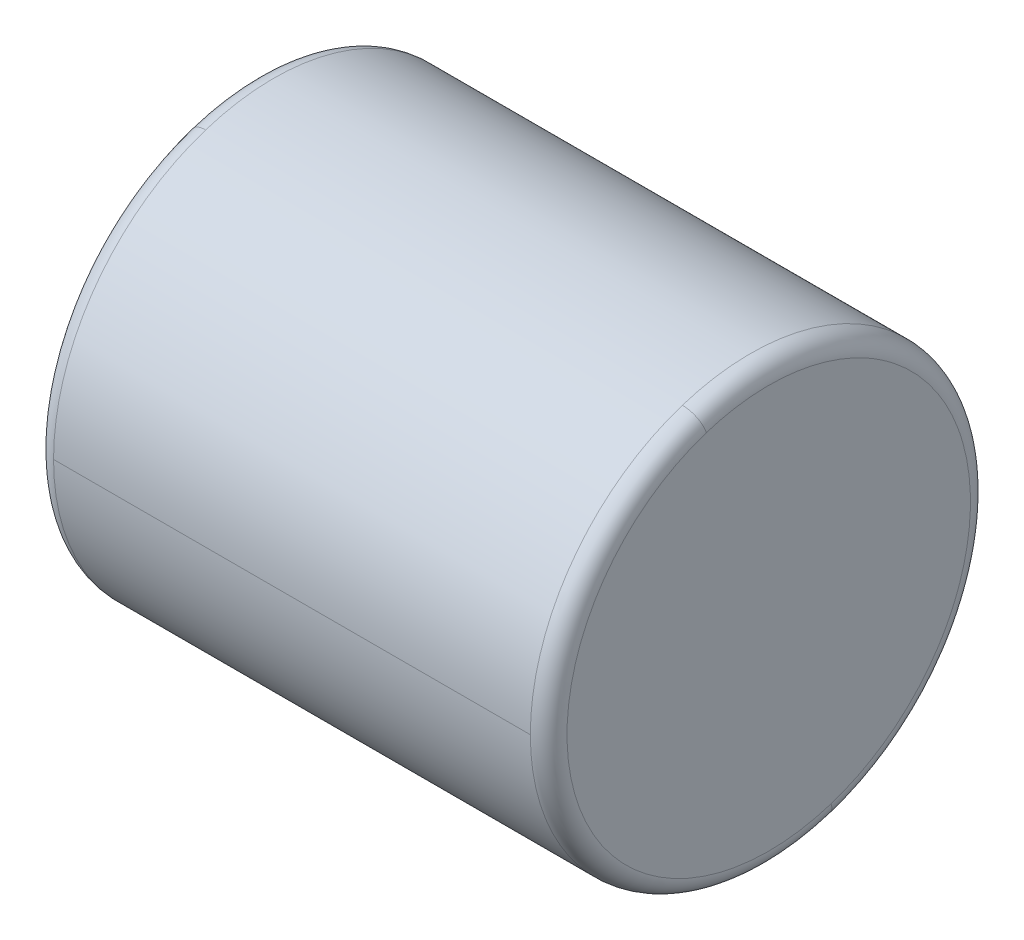
ISO-10303-21;
HEADER;
FILE_DESCRIPTION(('STEP AP214'),'2;1');
FILE_NAME('part.step','',(''),(''),'','','');
FILE_SCHEMA(('AUTOMOTIVE_DESIGN { 1 0 10303 214 1 1 1 1 }'));
ENDSEC;
DATA;
#1=APPLICATION_CONTEXT('core data for automotive mechanical design processes');
#2=APPLICATION_PROTOCOL_DEFINITION('international standard','automotive_design',2000,#1);
#3=PRODUCT_CONTEXT('',#1,'mechanical');
#4=PRODUCT('Part','Part','',(#3));
#5=PRODUCT_RELATED_PRODUCT_CATEGORY('part','',(#4));
#6=PRODUCT_DEFINITION_FORMATION('','',#4);
#7=PRODUCT_DEFINITION_CONTEXT('part definition',#1,'design');
#8=PRODUCT_DEFINITION('design','',#6,#7);
#9=PRODUCT_DEFINITION_SHAPE('','',#8);
#10=(LENGTH_UNIT() NAMED_UNIT(*) SI_UNIT(.MILLI.,.METRE.));
#11=(NAMED_UNIT(*) PLANE_ANGLE_UNIT() SI_UNIT($,.RADIAN.));
#12=(NAMED_UNIT(*) SI_UNIT($,.STERADIAN.) SOLID_ANGLE_UNIT());
#13=UNCERTAINTY_MEASURE_WITH_UNIT(LENGTH_MEASURE(1.E-05),#10,'distance_accuracy_value','');
#14=(GEOMETRIC_REPRESENTATION_CONTEXT(3) GLOBAL_UNCERTAINTY_ASSIGNED_CONTEXT((#13)) GLOBAL_UNIT_ASSIGNED_CONTEXT((#10,
#11,#12)) REPRESENTATION_CONTEXT('',''));
#15=CARTESIAN_POINT('',(0.,0.,0.));
#16=DIRECTION('',(0.,0.,1.));
#17=DIRECTION('',(1.,0.,0.));
#18=AXIS2_PLACEMENT_3D('',#15,#16,#17);
#19=CARTESIAN_POINT('',(3.5,39.,0.));
#20=DIRECTION('',(1.,0.,0.));
#21=DIRECTION('',(0.,0.,-1.));
#22=AXIS2_PLACEMENT_3D('',#19,#20,#21);
#23=PLANE('',#22);
#24=CARTESIAN_POINT('',(3.5,44.2308108396229,1.69959346906208));
#25=CARTESIAN_POINT('',(3.5,44.2030030939888,1.78518308762205));
#26=CARTESIAN_POINT('',(3.5,44.173091163384,1.87008884424502));
#27=CARTESIAN_POINT('',(3.5,44.1091388367265,2.03833106983926));
#28=CARTESIAN_POINT('',(3.5,44.0750984406738,2.12166753881053));
#29=CARTESIAN_POINT('',(3.5,44.002969087614,2.28656962532369));
#30=CARTESIAN_POINT('',(3.5,43.9648801306069,2.36813524286558));
#31=CARTESIAN_POINT('',(3.5,43.8847459784481,2.5292993418742));
#32=CARTESIAN_POINT('',(3.5,43.8427007832964,2.60889782334093));
#33=CARTESIAN_POINT('',(3.5,43.7547552945037,2.76593583312516));
#34=CARTESIAN_POINT('',(3.5,43.7088550008626,2.84337536144267));
#35=CARTESIAN_POINT('',(3.5,43.6133099333532,2.99590892169148));
#36=CARTESIAN_POINT('',(3.5,43.5636651594849,3.07100295362277));
#37=CARTESIAN_POINT('',(3.5,43.4607507192951,3.21866460888048));
#38=CARTESIAN_POINT('',(3.5,43.4074810529737,3.29123223220689));
#39=CARTESIAN_POINT('',(3.5,43.2974451620729,3.43366624959757));
#40=CARTESIAN_POINT('',(3.5,43.2406789374936,3.50353264366183));
#41=CARTESIAN_POINT('',(3.5,43.1237866841062,3.64039588796964));
#42=CARTESIAN_POINT('',(3.5,43.0636606552981,3.70739273821319));
#43=CARTESIAN_POINT('',(3.5,42.9401936425316,3.83835549367835));
#44=CARTESIAN_POINT('',(3.5,42.8768526585731,3.90232139889995));
#45=CARTESIAN_POINT('',(3.5,42.7471083294283,4.02706816483154));
#46=CARTESIAN_POINT('',(3.5,42.6807049842419,4.08784902554154));
#47=CARTESIAN_POINT('',(3.5,42.544995904131,4.20607927603838));
#48=CARTESIAN_POINT('',(3.5,42.4756901692065,4.26352866582523));
#49=CARTESIAN_POINT('',(3.5,42.3343432732012,4.37495757386229));
#50=CARTESIAN_POINT('',(3.5,42.2623021121204,4.42893709211251));
#51=CARTESIAN_POINT('',(3.5,42.1156579172708,4.53329621568919));
#52=CARTESIAN_POINT('',(3.5,42.0410548835019,4.58367582101566));
#53=CARTESIAN_POINT('',(3.5,41.8894666685186,4.68071374986278));
#54=CARTESIAN_POINT('',(3.5,41.8124814873042,4.72737207338344));
#55=CARTESIAN_POINT('',(3.5,41.6563144414746,4.81685503463081));
#56=CARTESIAN_POINT('',(3.5,41.5771325768593,4.85967967235753));
#57=CARTESIAN_POINT('',(3.5,41.4167629202753,4.94139209371376));
#58=CARTESIAN_POINT('',(3.5,41.3355751283066,4.98027987734326));
#59=CARTESIAN_POINT('',(3.5,41.1713892055177,5.05402490642811));
#60=CARTESIAN_POINT('',(3.5,41.0883910746976,5.08888215188346));
#61=CARTESIAN_POINT('',(3.5,40.9207844239728,5.15448213046259));
#62=CARTESIAN_POINT('',(3.5,40.8361759040681,5.18522486358635));
#63=CARTESIAN_POINT('',(3.5,40.6655523045096,5.24252175556546));
#64=CARTESIAN_POINT('',(3.5,40.5795372248558,5.2690759144208));
#65=CARTESIAN_POINT('',(3.5,40.4063077236598,5.3179316865685));
#66=CARTESIAN_POINT('',(3.5,40.3190933021177,5.34023329986087));
#67=CARTESIAN_POINT('',(3.5,40.1436752243257,5.3805302543428));
#68=CARTESIAN_POINT('',(3.5,40.0554715680758,5.39852559553238));
#69=CARTESIAN_POINT('',(3.5,39.878287511202,5.4301666534556));
#70=CARTESIAN_POINT('',(3.5,39.789307110578,5.44381237018925));
#71=CARTESIAN_POINT('',(3.5,39.6107839265349,5.4667213054738));
#72=CARTESIAN_POINT('',(3.5,39.5212411431158,5.47598452402469));
#73=CARTESIAN_POINT('',(3.5,39.3418089098905,5.49010614703887));
#74=CARTESIAN_POINT('',(3.5,39.2519194600844,5.49496455150216));
#75=CARTESIAN_POINT('',(3.5,39.0720104456432,5.50026484201923));
#76=CARTESIAN_POINT('',(3.5,38.9819908810081,5.50070672807301));
#77=CARTESIAN_POINT('',(3.5,38.802038501925,5.49717291722886));
#78=CARTESIAN_POINT('',(3.5,38.7121056874769,5.49319722033093));
#79=CARTESIAN_POINT('',(3.5,38.532543464795,5.4808378213854));
#80=CARTESIAN_POINT('',(3.5,38.4429140565612,5.47245411933782));
#81=CARTESIAN_POINT('',(3.5,38.2641745714027,5.45129890716554));
#82=CARTESIAN_POINT('',(3.5,38.1750644944781,5.43852739704085));
#83=CARTESIAN_POINT('',(3.5,37.9975783459186,5.40862733640092));
#84=CARTESIAN_POINT('',(3.5,37.9092022742837,5.39149878588567));
#85=CARTESIAN_POINT('',(3.5,37.7333970420009,5.3529259086431));
#86=CARTESIAN_POINT('',(3.5,37.6459678813531,5.33148158191578));
#87=CARTESIAN_POINT('',(3.5,37.4722670955504,5.28432881351043));
#88=CARTESIAN_POINT('',(3.5,37.3859954703956,5.25862037183242));
#89=CARTESIAN_POINT('',(3.5,37.2148175914803,5.20300130741348));
#90=CARTESIAN_POINT('',(3.5,37.1299113377199,5.17309068467256));
#91=CARTESIAN_POINT('',(3.5,36.9616687481958,5.10913931543787));
#92=CARTESIAN_POINT('',(3.5,36.8783324124321,5.0750985689441));
#93=CARTESIAN_POINT('',(3.5,36.7134304234337,5.00296895934363));
#94=CARTESIAN_POINT('',(3.5,36.6318647701989,4.96488009623692));
#95=CARTESIAN_POINT('',(3.5,36.4707006450613,4.884746012818));
#96=CARTESIAN_POINT('',(3.5,36.3911021731585,4.84270079250577));
#97=CARTESIAN_POINT('',(3.5,36.2340641703755,4.75475528529427));
#98=CARTESIAN_POINT('',(3.5,36.1566246394953,4.70885499839499));
#99=CARTESIAN_POINT('',(3.5,36.0040910773705,4.61330993582089));
#100=CARTESIAN_POINT('',(3.5,35.9289970461259,4.56366516014608));
#101=CARTESIAN_POINT('',(3.5,35.7813353913709,4.46075071863389));
#102=CARTESIAN_POINT('',(3.5,35.7087677678605,4.40748105279652));
#103=CARTESIAN_POINT('',(3.5,35.5663337503351,4.29744516225009));
#104=CARTESIAN_POINT('',(3.5,35.4964673563201,4.24067893754103));
#105=CARTESIAN_POINT('',(3.5,35.3596041120484,4.12378668405869));
#106=CARTESIAN_POINT('',(3.5,35.2926072617916,4.0636606552854));
#107=CARTESIAN_POINT('',(3.5,35.1616445063168,3.94019364254433));
#108=CARTESIAN_POINT('',(3.5,35.0976786010988,3.87685265857655));
#109=CARTESIAN_POINT('',(3.5,34.9729318351698,3.74710832942488));
#110=CARTESIAN_POINT('',(3.5,34.9121509744588,3.680704984241));
#111=CARTESIAN_POINT('',(3.5,34.7939207239613,3.54499590413192));
#112=CARTESIAN_POINT('',(3.5,34.7364713341747,3.47569016920673));
#113=CARTESIAN_POINT('',(3.5,34.6250424261378,3.33434327320094));
#114=CARTESIAN_POINT('',(3.5,34.5710629078875,3.26230211212034));
#115=CARTESIAN_POINT('',(3.5,34.4667037843108,3.11565791727084));
#116=CARTESIAN_POINT('',(3.5,34.4163241789843,3.04105488350194));
#117=CARTESIAN_POINT('',(3.5,34.3192862501372,2.88946666851863));
#118=CARTESIAN_POINT('',(3.5,34.2726279266166,2.81248148730423));
#119=CARTESIAN_POINT('',(3.5,34.1831449653692,2.65631444147458));
#120=CARTESIAN_POINT('',(3.5,34.1403203276425,2.57713257685932));
#121=CARTESIAN_POINT('',(3.5,34.0586079062862,2.41676292027534));
#122=CARTESIAN_POINT('',(3.5,34.0197201226568,2.33557512830661));
#123=CARTESIAN_POINT('',(3.5,33.9459750935719,2.17138920551772));
#124=CARTESIAN_POINT('',(3.5,33.9111178481165,2.08839107469757));
#125=CARTESIAN_POINT('',(3.5,33.8455178695374,1.92078442397279));
#126=CARTESIAN_POINT('',(3.5,33.8147751364137,1.83617590406817));
#127=CARTESIAN_POINT('',(3.5,33.7574782444345,1.66555230450964));
#128=CARTESIAN_POINT('',(3.5,33.7309240855789,1.57953722485574));
#129=CARTESIAN_POINT('',(3.5,33.6820683134318,1.40630772365988));
#130=CARTESIAN_POINT('',(3.5,33.6597667001401,1.31909330211792));
#131=CARTESIAN_POINT('',(3.5,33.6194697456563,1.14367522432541));
#132=CARTESIAN_POINT('',(3.5,33.6014744044641,1.05547156807484));
#133=CARTESIAN_POINT('',(3.5,33.5698333465479,0.878287511202944));
#134=CARTESIAN_POINT('',(3.5,33.5561876298239,0.789307110581609));
#135=CARTESIAN_POINT('',(3.5,33.5332786945131,0.610783926531369));
#136=CARTESIAN_POINT('',(3.5,33.5240154759263,0.521241143102463));
#137=CARTESIAN_POINT('',(3.5,33.5098938530101,0.341808909903803));
#138=CARTESIAN_POINT('',(3.5,33.5050354486808,0.251919460134048));
#139=CARTESIAN_POINT('',(3.5,33.4997351577979,0.0720104455935597));
#140=CARTESIAN_POINT('',(3.5,33.4992932712443,-0.0180091191771744));
#141=CARTESIAN_POINT('',(3.5,33.5028270834538,-0.19796149788968));
#142=CARTESIAN_POINT('',(3.5,33.5068027822168,-0.287894311831452));
#143=CARTESIAN_POINT('',(3.5,33.5191621760669,-0.46745653589656));
#144=CARTESIAN_POINT('',(3.5,33.527545871154,-0.557085946019896));
#145=CARTESIAN_POINT('',(3.5,33.5487011023426,-0.735825426016175));
#146=CARTESIAN_POINT('',(3.5,33.5614726384441,-0.824935495889118));
#147=CARTESIAN_POINT('',(3.5,33.5913726281141,-1.00242166371412));
#148=CARTESIAN_POINT('',(3.5,33.6085010816826,-1.09079776166617));
#149=CARTESIAN_POINT('',(3.5,33.6470742237886,-1.26660292204916));
#150=CARTESIAN_POINT('',(3.5,33.6685189123262,-1.35403198448008));
#151=CARTESIAN_POINT('',(3.5,33.7156706922476,-1.52773303861636));
#152=CARTESIAN_POINT('',(3.5,33.7413777836314,-1.61400503032172));
#153=CARTESIAN_POINT('',(3.5,33.7691891603771,-1.69959346906206));
#154=B_SPLINE_CURVE_WITH_KNOTS('',3,(#24,#25,#26,#27,#28,#29,#30,#31,#32,#33,#34,#35,#36,#37,
#38,#39,#40,#41,#42,#43,#44,#45,#46,#47,#48,#49,#50,#51,#52,#53,#54,#55,#56,#57,#58,#59,#60,#61,
#62,#63,#64,#65,#66,#67,#68,#69,#70,#71,#72,#73,#74,#75,#76,#77,#78,#79,#80,#81,#82,#83,#84,#85,
#86,#87,#88,#89,#90,#91,#92,#93,#94,#95,#96,#97,#98,#99,#100,#101,#102,#103,#104,#105,#106,#107,
#108,#109,#110,#111,#112,#113,#114,#115,#116,#117,#118,#119,#120,#121,#122,#123,#124,#125,#126,
#127,#128,#129,#130,#131,#132,#133,#134,#135,#136,#137,#138,#139,#140,#141,#142,#143,#144,#145,
#146,#147,#148,#149,#150,#151,#152,#153),.UNSPECIFIED.,.F.,.F.,(4,2,2,2,2,2,2,2,2,2,2,2,2,2,2,2,
2,2,2,2,2,2,2,2,2,2,2,2,2,2,2,2,2,2,2,2,2,2,2,2,2,2,2,2,2,2,2,2,2,2,2,2,2,2,2,2,2,2,2,2,2,2,2,2,
4),(0.,0.269953513752014,0.539907027504027,0.809860541256042,1.07981405500806,1.34976756876007,
1.61972108251209,1.8896745962641,2.15962811001611,2.42958162376813,2.69953513752014,
2.96948865127216,3.23944216502417,3.50939567877618,3.7793491925282,4.04930270628021,
4.31925622003223,4.58920973378424,4.85916324753626,5.12911676128827,5.39907027504028,
5.6690237887923,5.93897730254432,6.20893081629632,6.47888433004834,6.74883784380036,
7.01879135755237,7.28874487130439,7.55869838505639,7.82865189880841,8.09860541256043,
8.36855892631243,8.63851244006446,8.90846595381647,9.17841946756848,9.44837298132049,
9.71832649507251,9.98828000882452,10.2582335225765,10.5281870363286,10.7981405500806,
11.0680940638326,11.3380475775846,11.6080010913366,11.8779546050886,12.1479081188406,
12.4178616325927,12.6878151463447,12.9577686600967,13.2277221738487,13.4976756876007,
13.7676292013527,14.0375827151047,14.3075362288567,14.5774897426088,14.8474432563608,
15.1173967701128,15.3873502838648,15.6573037976168,15.9272573113688,16.1972108251208,
16.4671643388729,16.7371178526249,17.0070713663769,17.2770248801289),.UNSPECIFIED.);
#155=CARTESIAN_POINT('',(3.5,44.2308108396229,1.69959346906208));
#156=VERTEX_POINT('',#155);
#157=CARTESIAN_POINT('',(3.5,33.7691891603771,-1.69959346906208));
#158=VERTEX_POINT('',#157);
#159=EDGE_CURVE('E11',#156,#158,#154,.T.);
#160=ORIENTED_EDGE('',*,*,#159,.F.);
#161=CARTESIAN_POINT('',(3.5,33.7691891603771,-1.69959346906208));
#162=CARTESIAN_POINT('',(3.5,33.7969969060112,-1.78518308762205));
#163=CARTESIAN_POINT('',(3.5,33.826908836616,-1.87008884424502));
#164=CARTESIAN_POINT('',(3.5,33.8908611632735,-2.03833106983926));
#165=CARTESIAN_POINT('',(3.5,33.9249015593262,-2.12166753881052));
#166=CARTESIAN_POINT('',(3.5,33.997030912386,-2.28656962532368));
#167=CARTESIAN_POINT('',(3.5,34.0351198693931,-2.36813524286558));
#168=CARTESIAN_POINT('',(3.5,34.1152540215519,-2.5292993418742));
#169=CARTESIAN_POINT('',(3.5,34.1572992167036,-2.60889782334092));
#170=CARTESIAN_POINT('',(3.5,34.2452447054963,-2.76593583312516));
#171=CARTESIAN_POINT('',(3.5,34.2911449991374,-2.84337536144267));
#172=CARTESIAN_POINT('',(3.5,34.3866900666468,-2.99590892169148));
#173=CARTESIAN_POINT('',(3.5,34.4363348405151,-3.07100295362277));
#174=CARTESIAN_POINT('',(3.5,34.5392492807049,-3.21866460888048));
#175=CARTESIAN_POINT('',(3.5,34.5925189470263,-3.29123223220689));
#176=CARTESIAN_POINT('',(3.5,34.7025548379271,-3.43366624959757));
#177=CARTESIAN_POINT('',(3.5,34.7593210625064,-3.50353264366183));
#178=CARTESIAN_POINT('',(3.5,34.8762133158938,-3.64039588796964));
#179=CARTESIAN_POINT('',(3.5,34.9363393447019,-3.70739273821319));
#180=CARTESIAN_POINT('',(3.5,35.0598063574684,-3.83835549367835));
#181=CARTESIAN_POINT('',(3.5,35.1231473414269,-3.90232139889995));
#182=CARTESIAN_POINT('',(3.5,35.2528916705717,-4.02706816483154));
#183=CARTESIAN_POINT('',(3.5,35.3192950157581,-4.08784902554154));
#184=CARTESIAN_POINT('',(3.5,35.455004095869,-4.20607927603838));
#185=CARTESIAN_POINT('',(3.5,35.5243098307935,-4.26352866582523));
#186=CARTESIAN_POINT('',(3.5,35.6656567267988,-4.37495757386229));
#187=CARTESIAN_POINT('',(3.5,35.7376978878796,-4.4289370921125));
#188=CARTESIAN_POINT('',(3.5,35.8843420827292,-4.53329621568918));
#189=CARTESIAN_POINT('',(3.5,35.9589451164981,-4.58367582101565));
#190=CARTESIAN_POINT('',(3.5,36.1105333314813,-4.68071374986278));
#191=CARTESIAN_POINT('',(3.5,36.1875185126958,-4.72737207338343));
#192=CARTESIAN_POINT('',(3.5,36.3436855585254,-4.81685503463081));
#193=CARTESIAN_POINT('',(3.5,36.4228674231407,-4.85967967235753));
#194=CARTESIAN_POINT('',(3.5,36.5832370797247,-4.94139209371375));
#195=CARTESIAN_POINT('',(3.5,36.6644248716934,-4.98027987734326));
#196=CARTESIAN_POINT('',(3.5,36.8286107944823,-5.05402490642811));
#197=CARTESIAN_POINT('',(3.5,36.9116089253024,-5.08888215188346));
#198=CARTESIAN_POINT('',(3.5,37.0792155760272,-5.15448213046258));
#199=CARTESIAN_POINT('',(3.5,37.1638240959319,-5.18522486358635));
#200=CARTESIAN_POINT('',(3.5,37.3344476954904,-5.24252175556546));
#201=CARTESIAN_POINT('',(3.5,37.4204627751442,-5.2690759144208));
#202=CARTESIAN_POINT('',(3.5,37.5936922763402,-5.3179316865685));
#203=CARTESIAN_POINT('',(3.5,37.6809066978823,-5.34023329986087));
#204=CARTESIAN_POINT('',(3.5,37.8563247756743,-5.3805302543428));
#205=CARTESIAN_POINT('',(3.5,37.9445284319242,-5.39852559553237));
#206=CARTESIAN_POINT('',(3.5,38.121712488798,-5.4301666534556));
#207=CARTESIAN_POINT('',(3.5,38.210692889422,-5.44381237018925));
#208=CARTESIAN_POINT('',(3.5,38.3892160734651,-5.4667213054738));
#209=CARTESIAN_POINT('',(3.5,38.4787588568842,-5.47598452402469));
#210=CARTESIAN_POINT('',(3.5,38.6581910901095,-5.49010614703887));
#211=CARTESIAN_POINT('',(3.5,38.7480805399156,-5.49496455150216));
#212=CARTESIAN_POINT('',(3.5,38.9279895543568,-5.50026484201923));
#213=CARTESIAN_POINT('',(3.5,39.0180091189919,-5.50070672807301));
#214=CARTESIAN_POINT('',(3.5,39.197961498075,-5.49717291722886));
#215=CARTESIAN_POINT('',(3.5,39.2878943125231,-5.49319722033093));
#216=CARTESIAN_POINT('',(3.5,39.467456535205,-5.4808378213854));
#217=CARTESIAN_POINT('',(3.5,39.5570859434388,-5.47245411933782));
#218=CARTESIAN_POINT('',(3.5,39.7358254285973,-5.45129890716554));
#219=CARTESIAN_POINT('',(3.5,39.8249355055219,-5.43852739704085));
#220=CARTESIAN_POINT('',(3.5,40.0024216540814,-5.40862733640092));
#221=CARTESIAN_POINT('',(3.5,40.0907977257163,-5.39149878588567));
#222=CARTESIAN_POINT('',(3.5,40.266602957999,-5.3529259086431));
#223=CARTESIAN_POINT('',(3.5,40.3540321186469,-5.33148158191578));
#224=CARTESIAN_POINT('',(3.5,40.5277329044496,-5.28432881351044));
#225=CARTESIAN_POINT('',(3.5,40.6140045296044,-5.25862037183242));
#226=CARTESIAN_POINT('',(3.5,40.7851824085197,-5.20300130741348));
#227=CARTESIAN_POINT('',(3.5,40.8700886622801,-5.17309068467257));
#228=CARTESIAN_POINT('',(3.5,41.0383312518042,-5.10913931543788));
#229=CARTESIAN_POINT('',(3.5,41.1216675875679,-5.0750985689441));
#230=CARTESIAN_POINT('',(3.5,41.2865695765663,-5.00296895934363));
#231=CARTESIAN_POINT('',(3.5,41.3681352298011,-4.96488009623693));
#232=CARTESIAN_POINT('',(3.5,41.5292993549387,-4.884746012818));
#233=CARTESIAN_POINT('',(3.5,41.6088978268415,-4.84270079250578));
#234=CARTESIAN_POINT('',(3.5,41.7659358296245,-4.75475528529427));
#235=CARTESIAN_POINT('',(3.5,41.8433753605047,-4.70885499839499));
#236=CARTESIAN_POINT('',(3.5,41.9959089226295,-4.61330993582089));
#237=CARTESIAN_POINT('',(3.5,42.0710029538741,-4.56366516014608));
#238=CARTESIAN_POINT('',(3.5,42.2186646086291,-4.4607507186339));
#239=CARTESIAN_POINT('',(3.5,42.2912322321395,-4.40748105279652));
#240=CARTESIAN_POINT('',(3.5,42.4336662496649,-4.29744516225009));
#241=CARTESIAN_POINT('',(3.5,42.5035326436799,-4.24067893754103));
#242=CARTESIAN_POINT('',(3.5,42.6403958879516,-4.12378668405869));
#243=CARTESIAN_POINT('',(3.5,42.7073927382083,-4.0636606552854));
#244=CARTESIAN_POINT('',(3.5,42.8383554936832,-3.94019364254434));
#245=CARTESIAN_POINT('',(3.5,42.9023213989012,-3.87685265857655));
#246=CARTESIAN_POINT('',(3.5,43.0270681648302,-3.74710832942489));
#247=CARTESIAN_POINT('',(3.5,43.0878490255412,-3.680704984241));
#248=CARTESIAN_POINT('',(3.5,43.2060792760387,-3.54499590413193));
#249=CARTESIAN_POINT('',(3.5,43.2635286658253,-3.47569016920674));
#250=CARTESIAN_POINT('',(3.5,43.3749575738622,-3.33434327320095));
#251=CARTESIAN_POINT('',(3.5,43.4289370921125,-3.26230211212035));
#252=CARTESIAN_POINT('',(3.5,43.5332962156892,-3.11565791727085));
#253=CARTESIAN_POINT('',(3.5,43.5836758210157,-3.04105488350195));
#254=CARTESIAN_POINT('',(3.5,43.6807137498628,-2.88946666851864));
#255=CARTESIAN_POINT('',(3.5,43.7273720733834,-2.81248148730424));
#256=CARTESIAN_POINT('',(3.5,43.8168550346308,-2.65631444147458));
#257=CARTESIAN_POINT('',(3.5,43.8596796723575,-2.57713257685933));
#258=CARTESIAN_POINT('',(3.5,43.9413920937137,-2.41676292027534));
#259=CARTESIAN_POINT('',(3.5,43.9802798773432,-2.33557512830661));
#260=CARTESIAN_POINT('',(3.5,44.0540249064281,-2.17138920551773));
#261=CARTESIAN_POINT('',(3.5,44.0888821518835,-2.08839107469758));
#262=CARTESIAN_POINT('',(3.5,44.1544821304626,-1.9207844239728));
#263=CARTESIAN_POINT('',(3.5,44.1852248635863,-1.83617590406818));
#264=CARTESIAN_POINT('',(3.5,44.2425217555655,-1.66555230450965));
#265=CARTESIAN_POINT('',(3.5,44.2690759144211,-1.57953722485575));
#266=CARTESIAN_POINT('',(3.5,44.3179316865682,-1.40630772365989));
#267=CARTESIAN_POINT('',(3.5,44.3402332998599,-1.31909330211793));
#268=CARTESIAN_POINT('',(3.5,44.3805302543437,-1.14367522432541));
#269=CARTESIAN_POINT('',(3.5,44.3985255955359,-1.05547156807485));
#270=CARTESIAN_POINT('',(3.5,44.4301666534521,-0.878287511202953));
#271=CARTESIAN_POINT('',(3.5,44.4438123701761,-0.789307110581617));
#272=CARTESIAN_POINT('',(3.5,44.4667213054869,-0.610783926531376));
#273=CARTESIAN_POINT('',(3.5,44.4759845240737,-0.521241143102472));
#274=CARTESIAN_POINT('',(3.5,44.4901061469899,-0.341808909903813));
#275=CARTESIAN_POINT('',(3.5,44.4949645513192,-0.251919460134059));
#276=CARTESIAN_POINT('',(3.5,44.5002648422021,-0.0720104455935703));
#277=CARTESIAN_POINT('',(3.5,44.5007067287557,0.0180091191771639));
#278=CARTESIAN_POINT('',(3.5,44.4971729165462,0.19796149788967));
#279=CARTESIAN_POINT('',(3.5,44.4931972177832,0.287894311831441));
#280=CARTESIAN_POINT('',(3.5,44.4808378239331,0.467456535896549));
#281=CARTESIAN_POINT('',(3.5,44.472454128846,0.557085946019885));
#282=CARTESIAN_POINT('',(3.5,44.4512988976574,0.735825426016166));
#283=CARTESIAN_POINT('',(3.5,44.4385273615559,0.824935495889111));
#284=CARTESIAN_POINT('',(3.5,44.4086273718859,1.00242166371411));
#285=CARTESIAN_POINT('',(3.5,44.3914989183174,1.09079776166617));
#286=CARTESIAN_POINT('',(3.5,44.3529257762114,1.26660292204915));
#287=CARTESIAN_POINT('',(3.5,44.3314810876738,1.35403198448008));
#288=CARTESIAN_POINT('',(3.5,44.2843293077524,1.52773303861636));
#289=CARTESIAN_POINT('',(3.5,44.2586222163686,1.61400503032171));
#290=CARTESIAN_POINT('',(3.5,44.2308108396229,1.69959346906205));
#291=B_SPLINE_CURVE_WITH_KNOTS('',3,(#161,#162,#163,#164,#165,#166,#167,#168,#169,#170,#171,
#172,#173,#174,#175,#176,#177,#178,#179,#180,#181,#182,#183,#184,#185,#186,#187,#188,#189,#190,
#191,#192,#193,#194,#195,#196,#197,#198,#199,#200,#201,#202,#203,#204,#205,#206,#207,#208,#209,
#210,#211,#212,#213,#214,#215,#216,#217,#218,#219,#220,#221,#222,#223,#224,#225,#226,#227,#228,
#229,#230,#231,#232,#233,#234,#235,#236,#237,#238,#239,#240,#241,#242,#243,#244,#245,#246,#247,
#248,#249,#250,#251,#252,#253,#254,#255,#256,#257,#258,#259,#260,#261,#262,#263,#264,#265,#266,
#267,#268,#269,#270,#271,#272,#273,#274,#275,#276,#277,#278,#279,#280,#281,#282,#283,#284,#285,
#286,#287,#288,#289,#290),.UNSPECIFIED.,.F.,.F.,(4,2,2,2,2,2,2,2,2,2,2,2,2,2,2,2,2,2,2,2,2,2,2,
2,2,2,2,2,2,2,2,2,2,2,2,2,2,2,2,2,2,2,2,2,2,2,2,2,2,2,2,2,2,2,2,2,2,2,2,2,2,2,2,2,4),(0.,
0.269953513752015,0.539907027504026,0.809860541256041,1.07981405500806,1.34976756876007,
1.61972108251208,1.8896745962641,2.15962811001611,2.42958162376812,2.69953513752014,
2.96948865127215,3.23944216502417,3.50939567877618,3.7793491925282,4.04930270628021,
4.31925622003222,4.58920973378424,4.85916324753625,5.12911676128827,5.39907027504028,
5.6690237887923,5.93897730254431,6.20893081629632,6.47888433004834,6.74883784380035,
7.01879135755236,7.28874487130438,7.55869838505639,7.82865189880841,8.09860541256042,
8.36855892631243,8.63851244006445,8.90846595381646,9.17841946756847,9.44837298132049,
9.7183264950725,9.98828000882452,10.2582335225765,10.5281870363285,10.7981405500806,
11.0680940638326,11.3380475775846,11.6080010913366,11.8779546050886,12.1479081188406,
12.4178616325926,12.6878151463447,12.9577686600967,13.2277221738487,13.4976756876007,
13.7676292013527,14.0375827151047,14.3075362288567,14.5774897426088,14.8474432563608,
15.1173967701128,15.3873502838648,15.6573037976168,15.9272573113688,16.1972108251208,
16.4671643388729,16.7371178526249,17.0070713663769,17.2770248801289),.UNSPECIFIED.);
#292=EDGE_CURVE('E26',#158,#156,#291,.T.);
#293=ORIENTED_EDGE('',*,*,#292,.F.);
#294=EDGE_LOOP('',(#160,#293));
#295=FACE_BOUND('',#294,.T.);
#296=ADVANCED_FACE('F17',(#295),#23,.F.);
#297=CARTESIAN_POINT('',(4.00000000000042,39.,0.));
#298=DIRECTION('',(1.,0.,0.));
#299=DIRECTION('',(0.,-0.309016994374947,0.951056516295154));
#300=AXIS2_PLACEMENT_3D('',#297,#298,#299);
#301=TOROIDAL_SURFACE('',#300,5.49999999999958,0.50000000000042);
#302=CARTESIAN_POINT('',(4.00000000000042,33.7691891603771,-1.69959346906208));
#303=DIRECTION('',(0.,0.309016994374948,-0.951056516295153));
#304=DIRECTION('',(-8.43769498714413E-13,-0.951056516295153,-0.309016994374948));
#305=AXIS2_PLACEMENT_3D('',#302,#303,#304);
#306=CIRCLE('',#305,0.500000000000419);
#307=CARTESIAN_POINT('',(4.,33.2936609022291,-1.85410196624968));
#308=VERTEX_POINT('',#307);
#309=EDGE_CURVE('E139',#308,#158,#306,.T.);
#310=ORIENTED_EDGE('',*,*,#309,.T.);
#311=ORIENTED_EDGE('',*,*,#292,.T.);
#312=CARTESIAN_POINT('',(4.00000000000042,44.2308108396229,1.69959346906208));
#313=DIRECTION('',(0.,-0.309016994374948,0.951056516295153));
#314=DIRECTION('',(-8.42881320294713E-13,0.951056516295153,0.309016994374948));
#315=AXIS2_PLACEMENT_3D('',#312,#313,#314);
#316=CIRCLE('',#315,0.500000000000419);
#317=CARTESIAN_POINT('',(4.,44.7063390977709,1.85410196624968));
#318=VERTEX_POINT('',#317);
#319=EDGE_CURVE('E135',#318,#156,#316,.T.);
#320=ORIENTED_EDGE('',*,*,#319,.F.);
#321=CARTESIAN_POINT('',(4.,39.,0.));
#322=DIRECTION('',(1.,0.,0.));
#323=DIRECTION('',(0.,0.,-1.));
#324=AXIS2_PLACEMENT_3D('',#321,#322,#323);
#325=CIRCLE('',#324,6.);
#326=CARTESIAN_POINT('',(4.,39.,-6.));
#327=VERTEX_POINT('',#326);
#328=EDGE_CURVE('E130',#327,#318,#325,.T.);
#329=ORIENTED_EDGE('',*,*,#328,.F.);
#330=CARTESIAN_POINT('',(4.,39.,0.));
#331=DIRECTION('',(1.,0.,0.));
#332=DIRECTION('',(0.,0.,-1.));
#333=AXIS2_PLACEMENT_3D('',#330,#331,#332);
#334=CIRCLE('',#333,6.);
#335=EDGE_CURVE('E125',#308,#327,#334,.T.);
#336=ORIENTED_EDGE('',*,*,#335,.F.);
#337=EDGE_LOOP('',(#310,#311,#320,#329,#336));
#338=FACE_BOUND('',#337,.T.);
#339=ADVANCED_FACE('F146',(#338),#301,.T.);
#340=CARTESIAN_POINT('',(17.5,39.,0.));
#341=DIRECTION('',(1.,0.,0.));
#342=DIRECTION('',(0.,1.,0.));
#343=AXIS2_PLACEMENT_3D('',#340,#341,#342);
#344=CYLINDRICAL_SURFACE('',#343,6.);
#345=DIRECTION('',(1.,0.,0.));
#346=VECTOR('',#345,1.);
#347=CARTESIAN_POINT('',(4.,39.,6.));
#348=LINE('',#347,#346);
#349=CARTESIAN_POINT('',(4.,39.,6.));
#350=VERTEX_POINT('',#349);
#351=CARTESIAN_POINT('',(17.,39.,6.));
#352=VERTEX_POINT('',#351);
#353=EDGE_CURVE('E92',#350,#352,#348,.T.);
#354=ORIENTED_EDGE('',*,*,#353,.F.);
#355=CARTESIAN_POINT('',(4.,39.,0.));
#356=DIRECTION('',(1.,0.,0.));
#357=DIRECTION('',(0.,0.,-1.));
#358=AXIS2_PLACEMENT_3D('',#355,#356,#357);
#359=CIRCLE('',#358,6.);
#360=EDGE_CURVE('E117',#350,#308,#359,.T.);
#361=ORIENTED_EDGE('',*,*,#360,.T.);
#362=ORIENTED_EDGE('',*,*,#335,.T.);
#363=DIRECTION('',(1.,0.,0.));
#364=VECTOR('',#363,1.);
#365=CARTESIAN_POINT('',(4.,39.,-6.));
#366=LINE('',#365,#364);
#367=CARTESIAN_POINT('',(17.,39.,-6.));
#368=VERTEX_POINT('',#367);
#369=EDGE_CURVE('E113',#327,#368,#366,.T.);
#370=ORIENTED_EDGE('',*,*,#369,.T.);
#371=CARTESIAN_POINT('',(17.,39.,0.));
#372=DIRECTION('',(1.,0.,0.));
#373=DIRECTION('',(0.,0.,-1.));
#374=AXIS2_PLACEMENT_3D('',#371,#372,#373);
#375=CIRCLE('',#374,6.);
#376=CARTESIAN_POINT('',(17.,33.2936609022291,-1.85410196624968));
#377=VERTEX_POINT('',#376);
#378=EDGE_CURVE('E84',#377,#368,#375,.T.);
#379=ORIENTED_EDGE('',*,*,#378,.F.);
#380=CARTESIAN_POINT('',(17.,39.,0.));
#381=DIRECTION('',(1.,0.,0.));
#382=DIRECTION('',(0.,0.,-1.));
#383=AXIS2_PLACEMENT_3D('',#380,#381,#382);
#384=CIRCLE('',#383,6.);
#385=EDGE_CURVE('E106',#352,#377,#384,.T.);
#386=ORIENTED_EDGE('',*,*,#385,.F.);
#387=EDGE_LOOP('',(#354,#361,#362,#370,#379,#386));
#388=FACE_BOUND('',#387,.T.);
#389=ADVANCED_FACE('F155',(#388),#344,.T.);
#390=CARTESIAN_POINT('',(16.9999999999991,39.,0.));
#391=DIRECTION('',(1.,0.,0.));
#392=DIRECTION('',(0.,0.309016994374947,-0.951056516295154));
#393=AXIS2_PLACEMENT_3D('',#390,#391,#392);
#394=TOROIDAL_SURFACE('',#393,5.49999999999906,0.500000000000937);
#395=CARTESIAN_POINT('',(16.9999999999991,33.7691891603776,-1.69959346906192));
#396=DIRECTION('',(0.,0.309016994374947,-0.951056516295154));
#397=DIRECTION('',(1.,0.,0.));
#398=AXIS2_PLACEMENT_3D('',#395,#396,#397);
#399=CIRCLE('',#398,0.500000000000938);
#400=CARTESIAN_POINT('',(17.5,33.7691891603776,-1.69959346906192));
#401=VERTEX_POINT('',#400);
#402=EDGE_CURVE('E102',#401,#377,#399,.T.);
#403=ORIENTED_EDGE('',*,*,#402,.F.);
#404=CARTESIAN_POINT('',(17.5,39.,0.));
#405=DIRECTION('',(1.,0.,0.));
#406=DIRECTION('',(0.,0.,-1.));
#407=AXIS2_PLACEMENT_3D('',#404,#405,#406);
#408=CIRCLE('',#407,5.5);
#409=CARTESIAN_POINT('',(17.5,44.2308108396224,1.69959346906192));
#410=VERTEX_POINT('',#409);
#411=EDGE_CURVE('E74',#410,#401,#408,.T.);
#412=ORIENTED_EDGE('',*,*,#411,.F.);
#413=CARTESIAN_POINT('',(16.9999999999991,44.2308108396224,1.69959346906192));
#414=DIRECTION('',(0.,-0.309016994374947,0.951056516295154));
#415=DIRECTION('',(1.,0.,0.));
#416=AXIS2_PLACEMENT_3D('',#413,#414,#415);
#417=CIRCLE('',#416,0.500000000000938);
#418=CARTESIAN_POINT('',(17.,44.7063390977709,1.85410196624968));
#419=VERTEX_POINT('',#418);
#420=EDGE_CURVE('E67',#410,#419,#417,.T.);
#421=ORIENTED_EDGE('',*,*,#420,.T.);
#422=CARTESIAN_POINT('',(17.,39.,0.));
#423=DIRECTION('',(1.,0.,0.));
#424=DIRECTION('',(0.,0.,-1.));
#425=AXIS2_PLACEMENT_3D('',#422,#423,#424);
#426=CIRCLE('',#425,6.);
#427=EDGE_CURVE('E72',#419,#352,#426,.T.);
#428=ORIENTED_EDGE('',*,*,#427,.T.);
#429=ORIENTED_EDGE('',*,*,#385,.T.);
#430=EDGE_LOOP('',(#403,#412,#421,#428,#429));
#431=FACE_BOUND('',#430,.T.);
#432=ADVANCED_FACE('F69',(#431),#394,.T.);
#433=CARTESIAN_POINT('',(17.5,39.,0.));
#434=DIRECTION('',(1.,0.,0.));
#435=DIRECTION('',(0.,-1.,0.));
#436=AXIS2_PLACEMENT_3D('',#433,#434,#435);
#437=CYLINDRICAL_SURFACE('',#436,6.);
#438=ORIENTED_EDGE('',*,*,#353,.T.);
#439=ORIENTED_EDGE('',*,*,#427,.F.);
#440=CARTESIAN_POINT('',(17.,39.,0.));
#441=DIRECTION('',(1.,0.,0.));
#442=DIRECTION('',(0.,0.,-1.));
#443=AXIS2_PLACEMENT_3D('',#440,#441,#442);
#444=CIRCLE('',#443,6.);
#445=EDGE_CURVE('E81',#368,#419,#444,.T.);
#446=ORIENTED_EDGE('',*,*,#445,.F.);
#447=ORIENTED_EDGE('',*,*,#369,.F.);
#448=ORIENTED_EDGE('',*,*,#328,.T.);
#449=CARTESIAN_POINT('',(4.,39.,0.));
#450=DIRECTION('',(1.,0.,0.));
#451=DIRECTION('',(0.,0.,-1.));
#452=AXIS2_PLACEMENT_3D('',#449,#450,#451);
#453=CIRCLE('',#452,6.);
#454=EDGE_CURVE('E87',#318,#350,#453,.T.);
#455=ORIENTED_EDGE('',*,*,#454,.T.);
#456=EDGE_LOOP('',(#438,#439,#446,#447,#448,#455));
#457=FACE_BOUND('',#456,.T.);
#458=ADVANCED_FACE('F90',(#457),#437,.T.);
#459=CARTESIAN_POINT('',(4.00000000000042,39.,0.));
#460=DIRECTION('',(1.,0.,0.));
#461=DIRECTION('',(0.,0.309016994374947,-0.951056516295154));
#462=AXIS2_PLACEMENT_3D('',#459,#460,#461);
#463=TOROIDAL_SURFACE('',#462,5.49999999999958,0.50000000000042);
#464=ORIENTED_EDGE('',*,*,#309,.F.);
#465=ORIENTED_EDGE('',*,*,#360,.F.);
#466=ORIENTED_EDGE('',*,*,#454,.F.);
#467=ORIENTED_EDGE('',*,*,#319,.T.);
#468=ORIENTED_EDGE('',*,*,#159,.T.);
#469=EDGE_LOOP('',(#464,#465,#466,#467,#468));
#470=FACE_BOUND('',#469,.T.);
#471=ADVANCED_FACE('F164',(#470),#463,.T.);
#472=CARTESIAN_POINT('',(16.9999999999991,39.,0.));
#473=DIRECTION('',(1.,0.,0.));
#474=DIRECTION('',(0.,-0.309016994374947,0.951056516295154));
#475=AXIS2_PLACEMENT_3D('',#472,#473,#474);
#476=TOROIDAL_SURFACE('',#475,5.49999999999906,0.500000000000937);
#477=ORIENTED_EDGE('',*,*,#402,.T.);
#478=ORIENTED_EDGE('',*,*,#378,.T.);
#479=ORIENTED_EDGE('',*,*,#445,.T.);
#480=ORIENTED_EDGE('',*,*,#420,.F.);
#481=CARTESIAN_POINT('',(17.5,33.7691891603767,-1.69959346906221));
#482=CARTESIAN_POINT('',(17.5,34.3036326682821,-3.34217040804436));
#483=CARTESIAN_POINT('',(17.5,35.4802335659707,-4.77956892892113));
#484=CARTESIAN_POINT('',(17.5,37.203115909793,-5.65518590309598));
#485=CARTESIAN_POINT('',(17.5,40.9087566638721,-5.87454896087288));
#486=CARTESIAN_POINT('',(17.5,43.7777446387115,-3.51895953365164));
#487=CARTESIAN_POINT('',(17.5,44.6569109900954,-1.79788568784719));
#488=CARTESIAN_POINT('',(17.5,44.7639194596839,0.0565827987270007));
#489=CARTESIAN_POINT('',(17.5,44.2308108396233,1.69959346906221));
#490=B_SPLINE_CURVE_WITH_KNOTS('',5,(#481,#482,#483,#484,#485,#486,#487,#488,#489),
.UNSPECIFIED.,.F.,.F.,(6,3,6),(0.,1.5707963267949,3.14159265358979),.UNSPECIFIED.);
#491=EDGE_CURVE('E185',#401,#410,#490,.T.);
#492=ORIENTED_EDGE('',*,*,#491,.F.);
#493=EDGE_LOOP('',(#477,#478,#479,#480,#492));
#494=FACE_BOUND('',#493,.T.);
#495=ADVANCED_FACE('F83',(#494),#476,.T.);
#496=CARTESIAN_POINT('',(17.5,44.5,0.));
#497=DIRECTION('',(-1.,0.,0.));
#498=DIRECTION('',(0.,0.,1.));
#499=AXIS2_PLACEMENT_3D('',#496,#497,#498);
#500=PLANE('',#499);
#501=ORIENTED_EDGE('',*,*,#491,.T.);
#502=ORIENTED_EDGE('',*,*,#411,.T.);
#503=EDGE_LOOP('',(#501,#502));
#504=FACE_BOUND('',#503,.T.);
#505=ADVANCED_FACE('F191',(#504),#500,.F.);
#506=CLOSED_SHELL('',(#296,#339,#389,#432,#458,#471,#495,#505));
#507=MANIFOLD_SOLID_BREP('B1',#506);
#508=ADVANCED_BREP_SHAPE_REPRESENTATION('',(#18,#507),#14);
#509=SHAPE_DEFINITION_REPRESENTATION(#9,#508);
ENDSEC;
END-ISO-10303-21;
